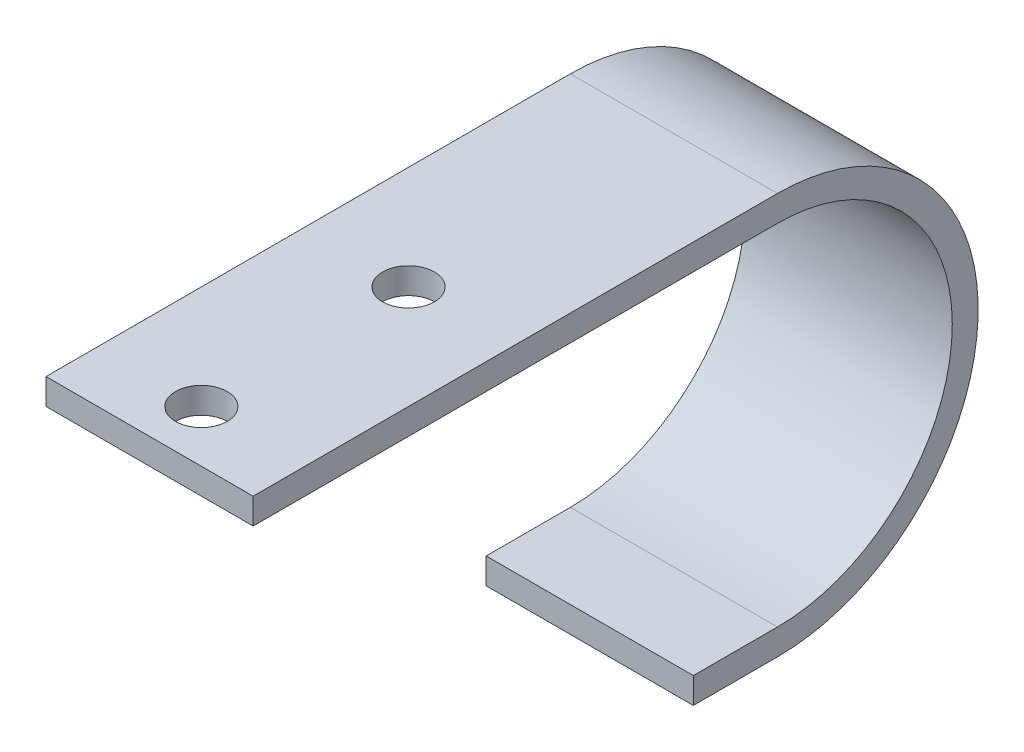
ISO-10303-21;
HEADER;
FILE_DESCRIPTION(('STEP AP214'),'2;1');
FILE_NAME('part.step','',(''),(''),'','','');
FILE_SCHEMA(('AUTOMOTIVE_DESIGN { 1 0 10303 214 1 1 1 1 }'));
ENDSEC;
DATA;
#1=APPLICATION_CONTEXT('core data for automotive mechanical design processes');
#2=APPLICATION_PROTOCOL_DEFINITION('international standard','automotive_design',2000,#1);
#3=PRODUCT_CONTEXT('',#1,'mechanical');
#4=PRODUCT('Part','Part','',(#3));
#5=PRODUCT_RELATED_PRODUCT_CATEGORY('part','',(#4));
#6=PRODUCT_DEFINITION_FORMATION('','',#4);
#7=PRODUCT_DEFINITION_CONTEXT('part definition',#1,'design');
#8=PRODUCT_DEFINITION('design','',#6,#7);
#9=PRODUCT_DEFINITION_SHAPE('','',#8);
#10=(LENGTH_UNIT() NAMED_UNIT(*) SI_UNIT(.MILLI.,.METRE.));
#11=(NAMED_UNIT(*) PLANE_ANGLE_UNIT() SI_UNIT($,.RADIAN.));
#12=(NAMED_UNIT(*) SI_UNIT($,.STERADIAN.) SOLID_ANGLE_UNIT());
#13=UNCERTAINTY_MEASURE_WITH_UNIT(LENGTH_MEASURE(1.E-05),#10,'distance_accuracy_value','');
#14=(GEOMETRIC_REPRESENTATION_CONTEXT(3) GLOBAL_UNCERTAINTY_ASSIGNED_CONTEXT((#13)) GLOBAL_UNIT_ASSIGNED_CONTEXT((#10,
#11,#12)) REPRESENTATION_CONTEXT('',''));
#15=CARTESIAN_POINT('',(0.,0.,0.));
#16=DIRECTION('',(0.,0.,1.));
#17=DIRECTION('',(1.,0.,0.));
#18=AXIS2_PLACEMENT_3D('',#15,#16,#17);
#19=CARTESIAN_POINT('',(0.,-3.175,-31.75));
#20=DIRECTION('',(0.,-1.,0.));
#21=DIRECTION('',(0.,0.,-1.));
#22=AXIS2_PLACEMENT_3D('',#19,#20,#21);
#23=CYLINDRICAL_SURFACE('',#22,3.175);
#24=CARTESIAN_POINT('',(0.,0.,-31.75));
#25=DIRECTION('',(0.,-1.,0.));
#26=DIRECTION('',(0.,0.,-1.));
#27=AXIS2_PLACEMENT_3D('',#24,#25,#26);
#28=CIRCLE('',#27,3.175);
#29=CARTESIAN_POINT('',(0.,0.,-34.925));
#30=VERTEX_POINT('',#29);
#31=EDGE_CURVE('E117',#30,#30,#28,.T.);
#32=ORIENTED_EDGE('',*,*,#31,.F.);
#33=EDGE_LOOP('',(#32));
#34=FACE_BOUND('',#33,.T.);
#35=CARTESIAN_POINT('',(0.,-3.175,-31.75));
#36=DIRECTION('',(0.,-1.,0.));
#37=DIRECTION('',(0.,0.,-1.));
#38=AXIS2_PLACEMENT_3D('',#35,#36,#37);
#39=CIRCLE('',#38,3.175);
#40=CARTESIAN_POINT('',(0.,-3.175,-34.925));
#41=VERTEX_POINT('',#40);
#42=EDGE_CURVE('E19',#41,#41,#39,.F.);
#43=ORIENTED_EDGE('',*,*,#42,.F.);
#44=EDGE_LOOP('',(#43));
#45=FACE_BOUND('',#44,.T.);
#46=ADVANCED_FACE('F16',(#34,#45),#23,.F.);
#47=CARTESIAN_POINT('',(0.,-3.175,-6.35));
#48=DIRECTION('',(0.,-1.,0.));
#49=DIRECTION('',(0.,0.,-1.));
#50=AXIS2_PLACEMENT_3D('',#47,#48,#49);
#51=CYLINDRICAL_SURFACE('',#50,3.175);
#52=CARTESIAN_POINT('',(0.,0.,-6.35));
#53=DIRECTION('',(0.,-1.,0.));
#54=DIRECTION('',(0.,0.,-1.));
#55=AXIS2_PLACEMENT_3D('',#52,#53,#54);
#56=CIRCLE('',#55,3.175);
#57=CARTESIAN_POINT('',(0.,0.,-9.525));
#58=VERTEX_POINT('',#57);
#59=EDGE_CURVE('E87',#58,#58,#56,.T.);
#60=ORIENTED_EDGE('',*,*,#59,.F.);
#61=EDGE_LOOP('',(#60));
#62=FACE_BOUND('',#61,.T.);
#63=CARTESIAN_POINT('',(0.,-3.175,-6.35));
#64=DIRECTION('',(0.,-1.,0.));
#65=DIRECTION('',(0.,0.,-1.));
#66=AXIS2_PLACEMENT_3D('',#63,#64,#65);
#67=CIRCLE('',#66,3.175);
#68=CARTESIAN_POINT('',(0.,-3.175,-9.525));
#69=VERTEX_POINT('',#68);
#70=EDGE_CURVE('E120',#69,#69,#67,.F.);
#71=ORIENTED_EDGE('',*,*,#70,.F.);
#72=EDGE_LOOP('',(#71));
#73=FACE_BOUND('',#72,.T.);
#74=ADVANCED_FACE('F131',(#62,#73),#51,.F.);
#75=CARTESIAN_POINT('',(-12.7,0.,0.));
#76=DIRECTION('',(0.,0.,1.));
#77=DIRECTION('',(1.,0.,0.));
#78=AXIS2_PLACEMENT_3D('',#75,#76,#77);
#79=PLANE('',#78);
#80=DIRECTION('',(1.,0.,0.));
#81=VECTOR('',#80,1.);
#82=CARTESIAN_POINT('',(-12.7,0.,0.));
#83=LINE('',#82,#81);
#84=CARTESIAN_POINT('',(-12.7,0.,0.));
#85=VERTEX_POINT('',#84);
#86=CARTESIAN_POINT('',(12.7,0.,0.));
#87=VERTEX_POINT('',#86);
#88=EDGE_CURVE('E119',#85,#87,#83,.T.);
#89=ORIENTED_EDGE('',*,*,#88,.F.);
#90=DIRECTION('',(0.,1.,0.));
#91=VECTOR('',#90,1.);
#92=CARTESIAN_POINT('',(-12.7,0.,0.));
#93=LINE('',#92,#91);
#94=CARTESIAN_POINT('',(-12.7,-3.175,0.));
#95=VERTEX_POINT('',#94);
#96=EDGE_CURVE('E78',#85,#95,#93,.F.);
#97=ORIENTED_EDGE('',*,*,#96,.T.);
#98=DIRECTION('',(1.,0.,0.));
#99=VECTOR('',#98,1.);
#100=CARTESIAN_POINT('',(-12.7,-3.175,0.));
#101=LINE('',#100,#99);
#102=CARTESIAN_POINT('',(12.7,-3.175,0.));
#103=VERTEX_POINT('',#102);
#104=EDGE_CURVE('E70',#103,#95,#101,.F.);
#105=ORIENTED_EDGE('',*,*,#104,.F.);
#106=DIRECTION('',(0.,1.,0.));
#107=VECTOR('',#106,1.);
#108=CARTESIAN_POINT('',(12.7,0.,0.));
#109=LINE('',#108,#107);
#110=EDGE_CURVE('E75',#87,#103,#109,.F.);
#111=ORIENTED_EDGE('',*,*,#110,.F.);
#112=EDGE_LOOP('',(#89,#97,#105,#111));
#113=FACE_BOUND('',#112,.T.);
#114=ADVANCED_FACE('F72',(#113),#79,.T.);
#115=CARTESIAN_POINT('',(-12.7,-3.175,0.));
#116=DIRECTION('',(0.,-1.,0.));
#117=DIRECTION('',(0.,0.,-1.));
#118=AXIS2_PLACEMENT_3D('',#115,#116,#117);
#119=PLANE('',#118);
#120=ORIENTED_EDGE('',*,*,#70,.T.);
#121=EDGE_LOOP('',(#120));
#122=FACE_BOUND('',#121,.T.);
#123=ORIENTED_EDGE('',*,*,#42,.T.);
#124=EDGE_LOOP('',(#123));
#125=FACE_BOUND('',#124,.T.);
#126=ORIENTED_EDGE('',*,*,#104,.T.);
#127=DIRECTION('',(0.,0.,-1.));
#128=VECTOR('',#127,1.);
#129=CARTESIAN_POINT('',(-12.7,-3.175,0.));
#130=LINE('',#129,#128);
#131=CARTESIAN_POINT('',(-12.7,-3.175,-64.29375));
#132=VERTEX_POINT('',#131);
#133=EDGE_CURVE('E112',#95,#132,#130,.T.);
#134=ORIENTED_EDGE('',*,*,#133,.T.);
#135=DIRECTION('',(1.,0.,0.));
#136=VECTOR('',#135,1.);
#137=CARTESIAN_POINT('',(-12.7,-3.175,-64.29375));
#138=LINE('',#137,#136);
#139=CARTESIAN_POINT('',(12.7,-3.175,-64.29375));
#140=VERTEX_POINT('',#139);
#141=EDGE_CURVE('E61',#132,#140,#138,.T.);
#142=ORIENTED_EDGE('',*,*,#141,.T.);
#143=DIRECTION('',(0.,0.,-1.));
#144=VECTOR('',#143,1.);
#145=CARTESIAN_POINT('',(12.7,-3.175,0.));
#146=LINE('',#145,#144);
#147=EDGE_CURVE('E82',#103,#140,#146,.T.);
#148=ORIENTED_EDGE('',*,*,#147,.F.);
#149=EDGE_LOOP('',(#126,#134,#142,#148));
#150=FACE_BOUND('',#149,.T.);
#151=ADVANCED_FACE('F83',(#122,#125,#150),#119,.T.);
#152=CARTESIAN_POINT('',(-12.7,-24.60625,-64.29375));
#153=DIRECTION('',(1.,0.,0.));
#154=DIRECTION('',(0.,0.,-1.));
#155=AXIS2_PLACEMENT_3D('',#152,#153,#154);
#156=CYLINDRICAL_SURFACE('',#155,21.43125);
#157=CARTESIAN_POINT('',(12.7,-24.60625,-64.29375));
#158=DIRECTION('',(1.,0.,0.));
#159=DIRECTION('',(0.,0.,-1.));
#160=AXIS2_PLACEMENT_3D('',#157,#158,#159);
#161=CIRCLE('',#160,21.43125);
#162=CARTESIAN_POINT('',(12.7,-46.0375,-64.29375));
#163=VERTEX_POINT('',#162);
#164=EDGE_CURVE('E86',#140,#163,#161,.F.);
#165=ORIENTED_EDGE('',*,*,#164,.F.);
#166=ORIENTED_EDGE('',*,*,#141,.F.);
#167=CARTESIAN_POINT('',(-12.7,-24.60625,-64.29375));
#168=DIRECTION('',(1.,0.,0.));
#169=DIRECTION('',(0.,0.,-1.));
#170=AXIS2_PLACEMENT_3D('',#167,#168,#169);
#171=CIRCLE('',#170,21.43125);
#172=CARTESIAN_POINT('',(-12.7,-46.0375,-64.29375));
#173=VERTEX_POINT('',#172);
#174=EDGE_CURVE('E109',#132,#173,#171,.F.);
#175=ORIENTED_EDGE('',*,*,#174,.T.);
#176=DIRECTION('',(1.,0.,0.));
#177=VECTOR('',#176,1.);
#178=CARTESIAN_POINT('',(-12.7,-46.0375,-64.29375));
#179=LINE('',#178,#177);
#180=EDGE_CURVE('E124',#163,#173,#179,.F.);
#181=ORIENTED_EDGE('',*,*,#180,.F.);
#182=EDGE_LOOP('',(#165,#166,#175,#181));
#183=FACE_BOUND('',#182,.T.);
#184=ADVANCED_FACE('F167',(#183),#156,.F.);
#185=CARTESIAN_POINT('',(-12.7,-46.0375,-64.29375));
#186=DIRECTION('',(0.,1.,0.));
#187=DIRECTION('',(0.,0.,1.));
#188=AXIS2_PLACEMENT_3D('',#185,#186,#187);
#189=PLANE('',#188);
#190=ORIENTED_EDGE('',*,*,#180,.T.);
#191=DIRECTION('',(0.,0.,-1.));
#192=VECTOR('',#191,1.);
#193=CARTESIAN_POINT('',(-12.7,-46.0375,0.));
#194=LINE('',#193,#192);
#195=CARTESIAN_POINT('',(-12.7,-46.0375,-53.975));
#196=VERTEX_POINT('',#195);
#197=EDGE_CURVE('E111',#173,#196,#194,.F.);
#198=ORIENTED_EDGE('',*,*,#197,.T.);
#199=DIRECTION('',(1.,0.,0.));
#200=VECTOR('',#199,1.);
#201=CARTESIAN_POINT('',(-12.7,-46.0375,-53.975));
#202=LINE('',#201,#200);
#203=CARTESIAN_POINT('',(12.7,-46.0375,-53.975));
#204=VERTEX_POINT('',#203);
#205=EDGE_CURVE('E270',#204,#196,#202,.F.);
#206=ORIENTED_EDGE('',*,*,#205,.F.);
#207=DIRECTION('',(0.,0.,-1.));
#208=VECTOR('',#207,1.);
#209=CARTESIAN_POINT('',(12.7,-46.0375,0.));
#210=LINE('',#209,#208);
#211=EDGE_CURVE('E114',#163,#204,#210,.F.);
#212=ORIENTED_EDGE('',*,*,#211,.F.);
#213=EDGE_LOOP('',(#190,#198,#206,#212));
#214=FACE_BOUND('',#213,.T.);
#215=ADVANCED_FACE('F163',(#214),#189,.T.);
#216=CARTESIAN_POINT('',(-12.7,-46.0375,-53.975));
#217=DIRECTION('',(0.,0.,1.));
#218=DIRECTION('',(1.,0.,0.));
#219=AXIS2_PLACEMENT_3D('',#216,#217,#218);
#220=PLANE('',#219);
#221=ORIENTED_EDGE('',*,*,#205,.T.);
#222=DIRECTION('',(0.,1.,0.));
#223=VECTOR('',#222,1.);
#224=CARTESIAN_POINT('',(-12.7,0.,-53.975));
#225=LINE('',#224,#223);
#226=CARTESIAN_POINT('',(-12.7,-49.2125,-53.975));
#227=VERTEX_POINT('',#226);
#228=EDGE_CURVE('E279',#196,#227,#225,.F.);
#229=ORIENTED_EDGE('',*,*,#228,.T.);
#230=DIRECTION('',(1.,0.,0.));
#231=VECTOR('',#230,1.);
#232=CARTESIAN_POINT('',(-12.7,-49.2125,-53.975));
#233=LINE('',#232,#231);
#234=CARTESIAN_POINT('',(12.7,-49.2125,-53.975));
#235=VERTEX_POINT('',#234);
#236=EDGE_CURVE('E95',#235,#227,#233,.F.);
#237=ORIENTED_EDGE('',*,*,#236,.F.);
#238=DIRECTION('',(0.,1.,0.));
#239=VECTOR('',#238,1.);
#240=CARTESIAN_POINT('',(12.7,0.,-53.975));
#241=LINE('',#240,#239);
#242=EDGE_CURVE('E97',#204,#235,#241,.F.);
#243=ORIENTED_EDGE('',*,*,#242,.F.);
#244=EDGE_LOOP('',(#221,#229,#237,#243));
#245=FACE_BOUND('',#244,.T.);
#246=ADVANCED_FACE('F159',(#245),#220,.T.);
#247=CARTESIAN_POINT('',(-12.7,0.,-64.29375));
#248=DIRECTION('',(0.,1.,0.));
#249=DIRECTION('',(0.,0.,1.));
#250=AXIS2_PLACEMENT_3D('',#247,#248,#249);
#251=PLANE('',#250);
#252=ORIENTED_EDGE('',*,*,#59,.T.);
#253=EDGE_LOOP('',(#252));
#254=FACE_BOUND('',#253,.T.);
#255=ORIENTED_EDGE('',*,*,#31,.T.);
#256=EDGE_LOOP('',(#255));
#257=FACE_BOUND('',#256,.T.);
#258=DIRECTION('',(1.,0.,0.));
#259=VECTOR('',#258,1.);
#260=CARTESIAN_POINT('',(-12.7,0.,-64.29375));
#261=LINE('',#260,#259);
#262=CARTESIAN_POINT('',(-12.7,0.,-64.29375));
#263=VERTEX_POINT('',#262);
#264=CARTESIAN_POINT('',(12.7,0.,-64.29375));
#265=VERTEX_POINT('',#264);
#266=EDGE_CURVE('E108',#263,#265,#261,.T.);
#267=ORIENTED_EDGE('',*,*,#266,.F.);
#268=DIRECTION('',(0.,0.,-1.));
#269=VECTOR('',#268,1.);
#270=CARTESIAN_POINT('',(-12.7,0.,0.));
#271=LINE('',#270,#269);
#272=EDGE_CURVE('E305',#263,#85,#271,.F.);
#273=ORIENTED_EDGE('',*,*,#272,.T.);
#274=ORIENTED_EDGE('',*,*,#88,.T.);
#275=DIRECTION('',(0.,0.,-1.));
#276=VECTOR('',#275,1.);
#277=CARTESIAN_POINT('',(12.7,0.,0.));
#278=LINE('',#277,#276);
#279=EDGE_CURVE('E91',#265,#87,#278,.F.);
#280=ORIENTED_EDGE('',*,*,#279,.F.);
#281=EDGE_LOOP('',(#267,#273,#274,#280));
#282=FACE_BOUND('',#281,.T.);
#283=ADVANCED_FACE('F156',(#254,#257,#282),#251,.T.);
#284=CARTESIAN_POINT('',(12.7,0.,0.));
#285=DIRECTION('',(1.,0.,0.));
#286=DIRECTION('',(0.,0.,-1.));
#287=AXIS2_PLACEMENT_3D('',#284,#285,#286);
#288=PLANE('',#287);
#289=ORIENTED_EDGE('',*,*,#279,.T.);
#290=ORIENTED_EDGE('',*,*,#110,.T.);
#291=ORIENTED_EDGE('',*,*,#147,.T.);
#292=ORIENTED_EDGE('',*,*,#164,.T.);
#293=ORIENTED_EDGE('',*,*,#211,.T.);
#294=ORIENTED_EDGE('',*,*,#242,.T.);
#295=DIRECTION('',(0.,0.,-1.));
#296=VECTOR('',#295,1.);
#297=CARTESIAN_POINT('',(12.7,-49.2125,-53.975));
#298=LINE('',#297,#296);
#299=CARTESIAN_POINT('',(12.7,-49.2125,-64.29375));
#300=VERTEX_POINT('',#299);
#301=EDGE_CURVE('E92',#300,#235,#298,.F.);
#302=ORIENTED_EDGE('',*,*,#301,.F.);
#303=CARTESIAN_POINT('',(12.7,-24.60625,-64.29375));
#304=DIRECTION('',(1.,0.,0.));
#305=DIRECTION('',(0.,0.,-1.));
#306=AXIS2_PLACEMENT_3D('',#303,#304,#305);
#307=CIRCLE('',#306,24.60625);
#308=EDGE_CURVE('E105',#265,#300,#307,.F.);
#309=ORIENTED_EDGE('',*,*,#308,.F.);
#310=EDGE_LOOP('',(#289,#290,#291,#292,#293,#294,#302,#309));
#311=FACE_BOUND('',#310,.T.);
#312=ADVANCED_FACE('F89',(#311),#288,.T.);
#313=CARTESIAN_POINT('',(-12.7,-49.2125,-53.975));
#314=DIRECTION('',(0.,-1.,0.));
#315=DIRECTION('',(0.,0.,-1.));
#316=AXIS2_PLACEMENT_3D('',#313,#314,#315);
#317=PLANE('',#316);
#318=ORIENTED_EDGE('',*,*,#236,.T.);
#319=DIRECTION('',(0.,0.,-1.));
#320=VECTOR('',#319,1.);
#321=CARTESIAN_POINT('',(-12.7,-49.2125,0.));
#322=LINE('',#321,#320);
#323=CARTESIAN_POINT('',(-12.7,-49.2125,-64.29375));
#324=VERTEX_POINT('',#323);
#325=EDGE_CURVE('E34',#227,#324,#322,.T.);
#326=ORIENTED_EDGE('',*,*,#325,.T.);
#327=DIRECTION('',(1.,0.,0.));
#328=VECTOR('',#327,1.);
#329=CARTESIAN_POINT('',(-12.7,-49.2125,-64.29375));
#330=LINE('',#329,#328);
#331=EDGE_CURVE('E25',#300,#324,#330,.F.);
#332=ORIENTED_EDGE('',*,*,#331,.F.);
#333=ORIENTED_EDGE('',*,*,#301,.T.);
#334=EDGE_LOOP('',(#318,#326,#332,#333));
#335=FACE_BOUND('',#334,.T.);
#336=ADVANCED_FACE('F147',(#335),#317,.T.);
#337=CARTESIAN_POINT('',(-12.7,0.,0.));
#338=DIRECTION('',(1.,0.,0.));
#339=DIRECTION('',(0.,0.,-1.));
#340=AXIS2_PLACEMENT_3D('',#337,#338,#339);
#341=PLANE('',#340);
#342=CARTESIAN_POINT('',(-12.7,-24.60625,-64.29375));
#343=DIRECTION('',(1.,0.,0.));
#344=DIRECTION('',(0.,0.,-1.));
#345=AXIS2_PLACEMENT_3D('',#342,#343,#344);
#346=CIRCLE('',#345,24.60625);
#347=EDGE_CURVE('E11',#324,#263,#346,.T.);
#348=ORIENTED_EDGE('',*,*,#347,.F.);
#349=ORIENTED_EDGE('',*,*,#325,.F.);
#350=ORIENTED_EDGE('',*,*,#228,.F.);
#351=ORIENTED_EDGE('',*,*,#197,.F.);
#352=ORIENTED_EDGE('',*,*,#174,.F.);
#353=ORIENTED_EDGE('',*,*,#133,.F.);
#354=ORIENTED_EDGE('',*,*,#96,.F.);
#355=ORIENTED_EDGE('',*,*,#272,.F.);
#356=EDGE_LOOP('',(#348,#349,#350,#351,#352,#353,#354,#355));
#357=FACE_BOUND('',#356,.T.);
#358=ADVANCED_FACE('F141',(#357),#341,.F.);
#359=CARTESIAN_POINT('',(-12.7,-24.60625,-64.29375));
#360=DIRECTION('',(1.,0.,0.));
#361=DIRECTION('',(0.,0.,-1.));
#362=AXIS2_PLACEMENT_3D('',#359,#360,#361);
#363=CYLINDRICAL_SURFACE('',#362,24.60625);
#364=ORIENTED_EDGE('',*,*,#331,.T.);
#365=ORIENTED_EDGE('',*,*,#347,.T.);
#366=ORIENTED_EDGE('',*,*,#266,.T.);
#367=ORIENTED_EDGE('',*,*,#308,.T.);
#368=EDGE_LOOP('',(#364,#365,#366,#367));
#369=FACE_BOUND('',#368,.T.);
#370=ADVANCED_FACE('F139',(#369),#363,.T.);
#371=CLOSED_SHELL('',(#46,#74,#114,#151,#184,#215,#246,#283,#312,#336,#358,#370));
#372=MANIFOLD_SOLID_BREP('B1',#371);
#373=ADVANCED_BREP_SHAPE_REPRESENTATION('',(#18,#372),#14);
#374=SHAPE_DEFINITION_REPRESENTATION(#9,#373);
ENDSEC;
END-ISO-10303-21;
